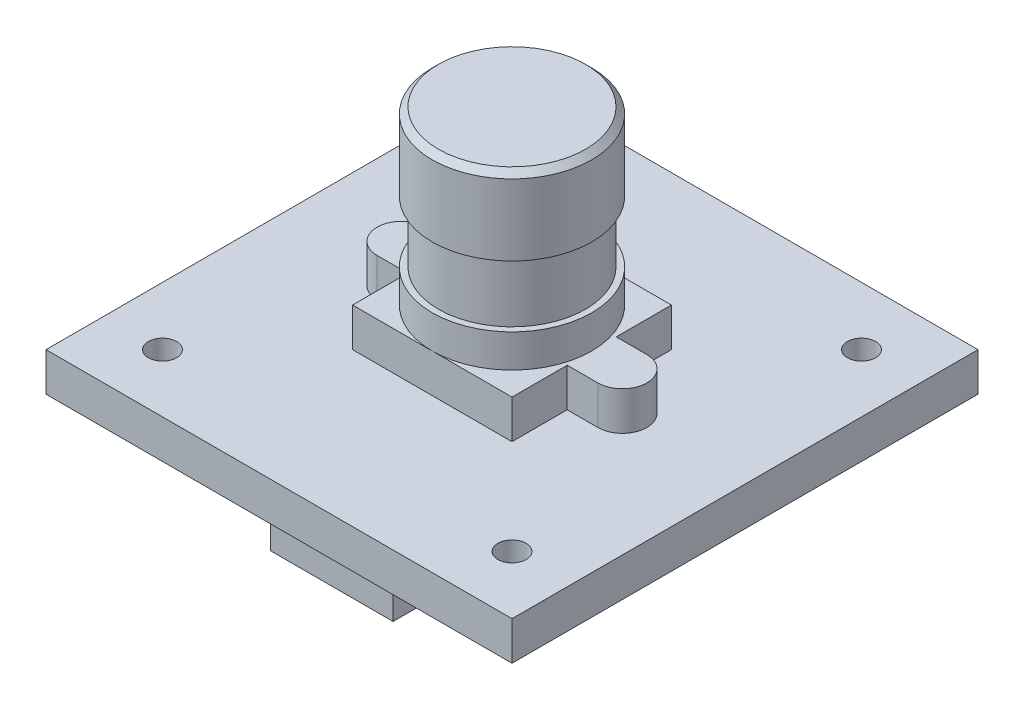
ISO-10303-21;
HEADER;
FILE_DESCRIPTION(('STEP AP214'),'2;1');
FILE_NAME('part.step','',(''),(''),'','','');
FILE_SCHEMA(('AUTOMOTIVE_DESIGN { 1 0 10303 214 1 1 1 1 }'));
ENDSEC;
DATA;
#1=APPLICATION_CONTEXT('core data for automotive mechanical design processes');
#2=APPLICATION_PROTOCOL_DEFINITION('international standard','automotive_design',2000,#1);
#3=PRODUCT_CONTEXT('',#1,'mechanical');
#4=PRODUCT('Part','Part','',(#3));
#5=PRODUCT_RELATED_PRODUCT_CATEGORY('part','',(#4));
#6=PRODUCT_DEFINITION_FORMATION('','',#4);
#7=PRODUCT_DEFINITION_CONTEXT('part definition',#1,'design');
#8=PRODUCT_DEFINITION('design','',#6,#7);
#9=PRODUCT_DEFINITION_SHAPE('','',#8);
#10=(LENGTH_UNIT() NAMED_UNIT(*) SI_UNIT(.MILLI.,.METRE.));
#11=(NAMED_UNIT(*) PLANE_ANGLE_UNIT() SI_UNIT($,.RADIAN.));
#12=(NAMED_UNIT(*) SI_UNIT($,.STERADIAN.) SOLID_ANGLE_UNIT());
#13=UNCERTAINTY_MEASURE_WITH_UNIT(LENGTH_MEASURE(1.E-05),#10,'distance_accuracy_value','');
#14=(GEOMETRIC_REPRESENTATION_CONTEXT(3) GLOBAL_UNCERTAINTY_ASSIGNED_CONTEXT((#13)) GLOBAL_UNIT_ASSIGNED_CONTEXT((#10,
#11,#12)) REPRESENTATION_CONTEXT('',''));
#15=CARTESIAN_POINT('',(0.,0.,0.));
#16=DIRECTION('',(0.,0.,1.));
#17=DIRECTION('',(1.,0.,0.));
#18=AXIS2_PLACEMENT_3D('',#15,#16,#17);
#19=CARTESIAN_POINT('',(0.,20.3,0.));
#20=DIRECTION('',(0.,-1.,0.));
#21=DIRECTION('',(0.,0.,-1.));
#22=AXIS2_PLACEMENT_3D('',#19,#20,#21);
#23=CYLINDRICAL_SURFACE('',#22,6.5);
#24=CARTESIAN_POINT('',(0.,6.3,0.));
#25=DIRECTION('',(0.,1.,0.));
#26=DIRECTION('',(0.,0.,1.));
#27=AXIS2_PLACEMENT_3D('',#24,#25,#26);
#28=CIRCLE('',#27,6.5);
#29=CARTESIAN_POINT('',(0.,6.3,6.5));
#30=VERTEX_POINT('',#29);
#31=CARTESIAN_POINT('',(0.,6.3,-6.5));
#32=VERTEX_POINT('',#31);
#33=EDGE_CURVE('E228',#30,#32,#28,.T.);
#34=ORIENTED_EDGE('',*,*,#33,.T.);
#35=EDGE_CURVE('E60',#32,#30,#28,.T.);
#36=ORIENTED_EDGE('',*,*,#35,.T.);
#37=EDGE_LOOP('',(#34,#36));
#38=FACE_BOUND('',#37,.T.);
#39=CARTESIAN_POINT('',(0.,9.,0.));
#40=DIRECTION('',(0.,1.,0.));
#41=DIRECTION('',(0.,0.,1.));
#42=AXIS2_PLACEMENT_3D('',#39,#40,#41);
#43=CIRCLE('',#42,6.5);
#44=CARTESIAN_POINT('',(0.,9.,6.5));
#45=VERTEX_POINT('',#44);
#46=EDGE_CURVE('E225',#45,#45,#43,.T.);
#47=ORIENTED_EDGE('',*,*,#46,.F.);
#48=EDGE_LOOP('',(#47));
#49=FACE_BOUND('',#48,.T.);
#50=ADVANCED_FACE('F37',(#38,#49),#23,.T.);
#51=CARTESIAN_POINT('',(-9.,6.3,0.));
#52=DIRECTION('',(0.,1.,0.));
#53=DIRECTION('',(0.,0.,1.));
#54=AXIS2_PLACEMENT_3D('',#51,#52,#53);
#55=PLANE('',#54);
#56=ORIENTED_EDGE('',*,*,#33,.F.);
#57=DIRECTION('',(-1.,0.,0.));
#58=VECTOR('',#57,1.);
#59=CARTESIAN_POINT('',(0.,6.3,6.5));
#60=LINE('',#59,#58);
#61=CARTESIAN_POINT('',(6.5,6.3,6.5));
#62=VERTEX_POINT('',#61);
#63=EDGE_CURVE('E246',#62,#30,#60,.T.);
#64=ORIENTED_EDGE('',*,*,#63,.F.);
#65=DIRECTION('',(0.,0.,-1.));
#66=VECTOR('',#65,1.);
#67=CARTESIAN_POINT('',(6.5,6.3,0.));
#68=LINE('',#67,#66);
#69=CARTESIAN_POINT('',(6.5,6.3,2.));
#70=VERTEX_POINT('',#69);
#71=EDGE_CURVE('E248',#62,#70,#68,.T.);
#72=ORIENTED_EDGE('',*,*,#71,.T.);
#73=DIRECTION('',(1.,0.,0.));
#74=VECTOR('',#73,1.);
#75=CARTESIAN_POINT('',(0.,6.3,1.99999999999999));
#76=LINE('',#75,#74);
#77=CARTESIAN_POINT('',(9.,6.3,2.));
#78=VERTEX_POINT('',#77);
#79=EDGE_CURVE('E250',#70,#78,#76,.T.);
#80=ORIENTED_EDGE('',*,*,#79,.T.);
#81=CARTESIAN_POINT('',(9.,6.3,0.));
#82=DIRECTION('',(0.,1.,0.));
#83=DIRECTION('',(0.,0.,1.));
#84=AXIS2_PLACEMENT_3D('',#81,#82,#83);
#85=CIRCLE('',#84,2.);
#86=CARTESIAN_POINT('',(9.,6.3,-2.));
#87=VERTEX_POINT('',#86);
#88=EDGE_CURVE('E252',#78,#87,#85,.T.);
#89=ORIENTED_EDGE('',*,*,#88,.T.);
#90=DIRECTION('',(1.,0.,0.));
#91=VECTOR('',#90,1.);
#92=CARTESIAN_POINT('',(0.,6.3,-2.));
#93=LINE('',#92,#91);
#94=CARTESIAN_POINT('',(6.5,6.3,-2.));
#95=VERTEX_POINT('',#94);
#96=EDGE_CURVE('E254',#95,#87,#93,.T.);
#97=ORIENTED_EDGE('',*,*,#96,.F.);
#98=DIRECTION('',(0.,0.,-1.));
#99=VECTOR('',#98,1.);
#100=CARTESIAN_POINT('',(6.5,6.3,0.));
#101=LINE('',#100,#99);
#102=CARTESIAN_POINT('',(6.5,6.3,-6.5));
#103=VERTEX_POINT('',#102);
#104=EDGE_CURVE('E257',#95,#103,#101,.T.);
#105=ORIENTED_EDGE('',*,*,#104,.T.);
#106=DIRECTION('',(-1.,0.,0.));
#107=VECTOR('',#106,1.);
#108=CARTESIAN_POINT('',(0.,6.3,-6.5));
#109=LINE('',#108,#107);
#110=EDGE_CURVE('E260',#103,#32,#109,.T.);
#111=ORIENTED_EDGE('',*,*,#110,.T.);
#112=EDGE_LOOP('',(#56,#64,#72,#80,#89,#97,#105,#111));
#113=FACE_BOUND('',#112,.T.);
#114=ADVANCED_FACE('F396',(#113),#55,.T.);
#115=CARTESIAN_POINT('',(0.,3.15,0.));
#116=DIRECTION('',(0.,1.,0.));
#117=DIRECTION('',(0.,0.,1.));
#118=AXIS2_PLACEMENT_3D('',#115,#116,#117);
#119=PLANE('',#118);
#120=CARTESIAN_POINT('',(14.25,3.15,14.25));
#121=DIRECTION('',(0.,1.,0.));
#122=DIRECTION('',(0.,0.,-1.));
#123=AXIS2_PLACEMENT_3D('',#120,#121,#122);
#124=CIRCLE('',#123,1.15);
#125=CARTESIAN_POINT('',(14.25,3.15,13.1));
#126=VERTEX_POINT('',#125);
#127=EDGE_CURVE('E338',#126,#126,#124,.T.);
#128=ORIENTED_EDGE('',*,*,#127,.F.);
#129=EDGE_LOOP('',(#128));
#130=FACE_BOUND('',#129,.T.);
#131=CARTESIAN_POINT('',(14.25,3.15,-14.25));
#132=DIRECTION('',(0.,1.,0.));
#133=DIRECTION('',(0.,0.,1.));
#134=AXIS2_PLACEMENT_3D('',#131,#132,#133);
#135=CIRCLE('',#134,1.15);
#136=CARTESIAN_POINT('',(14.25,3.15,-13.1));
#137=VERTEX_POINT('',#136);
#138=EDGE_CURVE('E350',#137,#137,#135,.T.);
#139=ORIENTED_EDGE('',*,*,#138,.F.);
#140=EDGE_LOOP('',(#139));
#141=FACE_BOUND('',#140,.T.);
#142=DIRECTION('',(0.,0.,1.));
#143=VECTOR('',#142,1.);
#144=CARTESIAN_POINT('',(-19.,3.15,-19.));
#145=LINE('',#144,#143);
#146=CARTESIAN_POINT('',(-19.,3.15,-19.));
#147=VERTEX_POINT('',#146);
#148=CARTESIAN_POINT('',(-19.,3.15,19.));
#149=VERTEX_POINT('',#148);
#150=EDGE_CURVE('E356',#147,#149,#145,.T.);
#151=ORIENTED_EDGE('',*,*,#150,.T.);
#152=DIRECTION('',(1.,0.,0.));
#153=VECTOR('',#152,1.);
#154=CARTESIAN_POINT('',(-19.,3.15,19.));
#155=LINE('',#154,#153);
#156=CARTESIAN_POINT('',(19.,3.15,19.));
#157=VERTEX_POINT('',#156);
#158=EDGE_CURVE('E359',#149,#157,#155,.T.);
#159=ORIENTED_EDGE('',*,*,#158,.T.);
#160=DIRECTION('',(0.,0.,-1.));
#161=VECTOR('',#160,1.);
#162=CARTESIAN_POINT('',(19.,3.15,-19.));
#163=LINE('',#162,#161);
#164=CARTESIAN_POINT('',(19.,3.15,-19.));
#165=VERTEX_POINT('',#164);
#166=EDGE_CURVE('E362',#157,#165,#163,.T.);
#167=ORIENTED_EDGE('',*,*,#166,.T.);
#168=DIRECTION('',(-1.,0.,0.));
#169=VECTOR('',#168,1.);
#170=CARTESIAN_POINT('',(-19.,3.15,-19.));
#171=LINE('',#170,#169);
#172=EDGE_CURVE('E364',#165,#147,#171,.T.);
#173=ORIENTED_EDGE('',*,*,#172,.T.);
#174=EDGE_LOOP('',(#151,#159,#167,#173));
#175=FACE_BOUND('',#174,.T.);
#176=CARTESIAN_POINT('',(-14.25,3.15,-14.25));
#177=DIRECTION('',(0.,1.,0.));
#178=DIRECTION('',(0.,0.,-1.));
#179=AXIS2_PLACEMENT_3D('',#176,#177,#178);
#180=CIRCLE('',#179,1.15);
#181=CARTESIAN_POINT('',(-14.25,3.15,-15.4));
#182=VERTEX_POINT('',#181);
#183=EDGE_CURVE('E344',#182,#182,#180,.T.);
#184=ORIENTED_EDGE('',*,*,#183,.F.);
#185=EDGE_LOOP('',(#184));
#186=FACE_BOUND('',#185,.T.);
#187=CARTESIAN_POINT('',(-14.25,3.15,14.25));
#188=DIRECTION('',(0.,1.,0.));
#189=DIRECTION('',(0.,0.,1.));
#190=AXIS2_PLACEMENT_3D('',#187,#188,#189);
#191=CIRCLE('',#190,1.15);
#192=CARTESIAN_POINT('',(-14.25,3.15,15.4));
#193=VERTEX_POINT('',#192);
#194=EDGE_CURVE('E332',#193,#193,#191,.T.);
#195=ORIENTED_EDGE('',*,*,#194,.F.);
#196=EDGE_LOOP('',(#195));
#197=FACE_BOUND('',#196,.T.);
#198=CARTESIAN_POINT('',(-9.,3.15,0.));
#199=DIRECTION('',(0.,1.,0.));
#200=DIRECTION('',(0.,0.,1.));
#201=AXIS2_PLACEMENT_3D('',#198,#199,#200);
#202=CIRCLE('',#201,2.);
#203=CARTESIAN_POINT('',(-9.,3.15,-2.));
#204=VERTEX_POINT('',#203);
#205=CARTESIAN_POINT('',(-9.,3.15,2.));
#206=VERTEX_POINT('',#205);
#207=EDGE_CURVE('E269',#204,#206,#202,.T.);
#208=ORIENTED_EDGE('',*,*,#207,.F.);
#209=DIRECTION('',(-1.,0.,0.));
#210=VECTOR('',#209,1.);
#211=CARTESIAN_POINT('',(0.,3.15,-2.));
#212=LINE('',#211,#210);
#213=CARTESIAN_POINT('',(-6.5,3.15,-2.));
#214=VERTEX_POINT('',#213);
#215=EDGE_CURVE('E231',#214,#204,#212,.T.);
#216=ORIENTED_EDGE('',*,*,#215,.F.);
#217=DIRECTION('',(0.,0.,-1.));
#218=VECTOR('',#217,1.);
#219=CARTESIAN_POINT('',(-6.5,3.15,0.));
#220=LINE('',#219,#218);
#221=CARTESIAN_POINT('',(-6.5,3.15,-6.5));
#222=VERTEX_POINT('',#221);
#223=EDGE_CURVE('E237',#214,#222,#220,.T.);
#224=ORIENTED_EDGE('',*,*,#223,.T.);
#225=DIRECTION('',(-1.,0.,0.));
#226=VECTOR('',#225,1.);
#227=CARTESIAN_POINT('',(0.,3.15,-6.5));
#228=LINE('',#227,#226);
#229=CARTESIAN_POINT('',(6.5,3.15,-6.5));
#230=VERTEX_POINT('',#229);
#231=EDGE_CURVE('E292',#230,#222,#228,.T.);
#232=ORIENTED_EDGE('',*,*,#231,.F.);
#233=DIRECTION('',(0.,0.,-1.));
#234=VECTOR('',#233,1.);
#235=CARTESIAN_POINT('',(6.5,3.15,0.));
#236=LINE('',#235,#234);
#237=CARTESIAN_POINT('',(6.5,3.15,-2.));
#238=VERTEX_POINT('',#237);
#239=EDGE_CURVE('E289',#238,#230,#236,.T.);
#240=ORIENTED_EDGE('',*,*,#239,.F.);
#241=DIRECTION('',(1.,0.,0.));
#242=VECTOR('',#241,1.);
#243=CARTESIAN_POINT('',(0.,3.15,-2.));
#244=LINE('',#243,#242);
#245=CARTESIAN_POINT('',(9.,3.15,-2.));
#246=VERTEX_POINT('',#245);
#247=EDGE_CURVE('E287',#238,#246,#244,.T.);
#248=ORIENTED_EDGE('',*,*,#247,.T.);
#249=CARTESIAN_POINT('',(9.,3.15,0.));
#250=DIRECTION('',(0.,1.,0.));
#251=DIRECTION('',(0.,0.,1.));
#252=AXIS2_PLACEMENT_3D('',#249,#250,#251);
#253=CIRCLE('',#252,2.);
#254=CARTESIAN_POINT('',(9.,3.15,2.));
#255=VERTEX_POINT('',#254);
#256=EDGE_CURVE('E284',#255,#246,#253,.T.);
#257=ORIENTED_EDGE('',*,*,#256,.F.);
#258=DIRECTION('',(1.,0.,0.));
#259=VECTOR('',#258,1.);
#260=CARTESIAN_POINT('',(0.,3.15,1.99999999999999));
#261=LINE('',#260,#259);
#262=CARTESIAN_POINT('',(6.5,3.15,2.));
#263=VERTEX_POINT('',#262);
#264=EDGE_CURVE('E281',#263,#255,#261,.T.);
#265=ORIENTED_EDGE('',*,*,#264,.F.);
#266=DIRECTION('',(0.,0.,-1.));
#267=VECTOR('',#266,1.);
#268=CARTESIAN_POINT('',(6.5,3.15,0.));
#269=LINE('',#268,#267);
#270=CARTESIAN_POINT('',(6.5,3.15,6.5));
#271=VERTEX_POINT('',#270);
#272=EDGE_CURVE('E278',#271,#263,#269,.T.);
#273=ORIENTED_EDGE('',*,*,#272,.F.);
#274=DIRECTION('',(-1.,0.,0.));
#275=VECTOR('',#274,1.);
#276=CARTESIAN_POINT('',(0.,3.15,6.5));
#277=LINE('',#276,#275);
#278=CARTESIAN_POINT('',(-6.5,3.15,6.5));
#279=VERTEX_POINT('',#278);
#280=EDGE_CURVE('E276',#271,#279,#277,.T.);
#281=ORIENTED_EDGE('',*,*,#280,.T.);
#282=DIRECTION('',(0.,0.,-1.));
#283=VECTOR('',#282,1.);
#284=CARTESIAN_POINT('',(-6.5,3.15,0.));
#285=LINE('',#284,#283);
#286=CARTESIAN_POINT('',(-6.5,3.15,2.));
#287=VERTEX_POINT('',#286);
#288=EDGE_CURVE('E274',#279,#287,#285,.T.);
#289=ORIENTED_EDGE('',*,*,#288,.T.);
#290=DIRECTION('',(-1.,0.,0.));
#291=VECTOR('',#290,1.);
#292=CARTESIAN_POINT('',(0.,3.15,1.99999999999999));
#293=LINE('',#292,#291);
#294=EDGE_CURVE('E272',#287,#206,#293,.T.);
#295=ORIENTED_EDGE('',*,*,#294,.T.);
#296=EDGE_LOOP('',(#208,#216,#224,#232,#240,#248,#257,#265,#273,#281,#289,#295));
#297=FACE_BOUND('',#296,.T.);
#298=ADVANCED_FACE('F445',(#130,#141,#175,#186,#197,#297),#119,.T.);
#299=CARTESIAN_POINT('',(0.,0.,0.));
#300=DIRECTION('',(0.,1.,0.));
#301=DIRECTION('',(0.,0.,1.));
#302=AXIS2_PLACEMENT_3D('',#299,#300,#301);
#303=PLANE('',#302);
#304=DIRECTION('',(-1.,0.,0.));
#305=VECTOR('',#304,1.);
#306=CARTESIAN_POINT('',(-5.,0.,10.));
#307=LINE('',#306,#305);
#308=CARTESIAN_POINT('',(5.,0.,9.99999999999999));
#309=VERTEX_POINT('',#308);
#310=CARTESIAN_POINT('',(-5.,0.,10.));
#311=VERTEX_POINT('',#310);
#312=EDGE_CURVE('E206',#309,#311,#307,.T.);
#313=ORIENTED_EDGE('',*,*,#312,.T.);
#314=DIRECTION('',(0.,0.,1.));
#315=VECTOR('',#314,1.);
#316=CARTESIAN_POINT('',(-5.,0.,10.));
#317=LINE('',#316,#315);
#318=CARTESIAN_POINT('',(-5.,0.,14.7));
#319=VERTEX_POINT('',#318);
#320=EDGE_CURVE('E213',#311,#319,#317,.T.);
#321=ORIENTED_EDGE('',*,*,#320,.T.);
#322=DIRECTION('',(1.,0.,0.));
#323=VECTOR('',#322,1.);
#324=CARTESIAN_POINT('',(-5.,0.,14.7));
#325=LINE('',#324,#323);
#326=CARTESIAN_POINT('',(5.,0.,14.7));
#327=VERTEX_POINT('',#326);
#328=EDGE_CURVE('E186',#319,#327,#325,.T.);
#329=ORIENTED_EDGE('',*,*,#328,.T.);
#330=DIRECTION('',(0.,0.,-1.));
#331=VECTOR('',#330,1.);
#332=CARTESIAN_POINT('',(5.,0.,9.99999999999999));
#333=LINE('',#332,#331);
#334=EDGE_CURVE('E52',#327,#309,#333,.T.);
#335=ORIENTED_EDGE('',*,*,#334,.T.);
#336=EDGE_LOOP('',(#313,#321,#329,#335));
#337=FACE_BOUND('',#336,.T.);
#338=DIRECTION('',(0.,0.,1.));
#339=VECTOR('',#338,1.);
#340=CARTESIAN_POINT('',(-19.,0.,-19.));
#341=LINE('',#340,#339);
#342=CARTESIAN_POINT('',(-19.,0.,-19.));
#343=VERTEX_POINT('',#342);
#344=CARTESIAN_POINT('',(-19.,0.,19.));
#345=VERTEX_POINT('',#344);
#346=EDGE_CURVE('E353',#343,#345,#341,.T.);
#347=ORIENTED_EDGE('',*,*,#346,.F.);
#348=DIRECTION('',(-1.,0.,0.));
#349=VECTOR('',#348,1.);
#350=CARTESIAN_POINT('',(-19.,0.,-19.));
#351=LINE('',#350,#349);
#352=CARTESIAN_POINT('',(19.,0.,-19.));
#353=VERTEX_POINT('',#352);
#354=EDGE_CURVE('E360',#353,#343,#351,.T.);
#355=ORIENTED_EDGE('',*,*,#354,.F.);
#356=DIRECTION('',(0.,0.,-1.));
#357=VECTOR('',#356,1.);
#358=CARTESIAN_POINT('',(19.,0.,-19.));
#359=LINE('',#358,#357);
#360=CARTESIAN_POINT('',(19.,0.,19.));
#361=VERTEX_POINT('',#360);
#362=EDGE_CURVE('E371',#361,#353,#359,.T.);
#363=ORIENTED_EDGE('',*,*,#362,.F.);
#364=DIRECTION('',(1.,0.,0.));
#365=VECTOR('',#364,1.);
#366=CARTESIAN_POINT('',(-19.,0.,19.));
#367=LINE('',#366,#365);
#368=EDGE_CURVE('E369',#345,#361,#367,.T.);
#369=ORIENTED_EDGE('',*,*,#368,.F.);
#370=EDGE_LOOP('',(#347,#355,#363,#369));
#371=FACE_BOUND('',#370,.T.);
#372=CARTESIAN_POINT('',(14.25,0.,-14.25));
#373=DIRECTION('',(0.,1.,0.));
#374=DIRECTION('',(0.,0.,1.));
#375=AXIS2_PLACEMENT_3D('',#372,#373,#374);
#376=CIRCLE('',#375,1.15);
#377=CARTESIAN_POINT('',(14.25,0.,-13.1));
#378=VERTEX_POINT('',#377);
#379=EDGE_CURVE('E347',#378,#378,#376,.T.);
#380=ORIENTED_EDGE('',*,*,#379,.T.);
#381=EDGE_LOOP('',(#380));
#382=FACE_BOUND('',#381,.T.);
#383=CARTESIAN_POINT('',(-14.25,0.,-14.25));
#384=DIRECTION('',(0.,1.,0.));
#385=DIRECTION('',(0.,0.,-1.));
#386=AXIS2_PLACEMENT_3D('',#383,#384,#385);
#387=CIRCLE('',#386,1.15);
#388=CARTESIAN_POINT('',(-14.25,0.,-15.4));
#389=VERTEX_POINT('',#388);
#390=EDGE_CURVE('E341',#389,#389,#387,.T.);
#391=ORIENTED_EDGE('',*,*,#390,.T.);
#392=EDGE_LOOP('',(#391));
#393=FACE_BOUND('',#392,.T.);
#394=CARTESIAN_POINT('',(14.25,0.,14.25));
#395=DIRECTION('',(0.,1.,0.));
#396=DIRECTION('',(0.,0.,-1.));
#397=AXIS2_PLACEMENT_3D('',#394,#395,#396);
#398=CIRCLE('',#397,1.15);
#399=CARTESIAN_POINT('',(14.25,0.,13.1));
#400=VERTEX_POINT('',#399);
#401=EDGE_CURVE('E335',#400,#400,#398,.T.);
#402=ORIENTED_EDGE('',*,*,#401,.T.);
#403=EDGE_LOOP('',(#402));
#404=FACE_BOUND('',#403,.T.);
#405=CARTESIAN_POINT('',(-14.25,0.,14.25));
#406=DIRECTION('',(0.,1.,0.));
#407=DIRECTION('',(0.,0.,1.));
#408=AXIS2_PLACEMENT_3D('',#405,#406,#407);
#409=CIRCLE('',#408,1.15);
#410=CARTESIAN_POINT('',(-14.25,0.,15.4));
#411=VERTEX_POINT('',#410);
#412=EDGE_CURVE('E331',#411,#411,#409,.T.);
#413=ORIENTED_EDGE('',*,*,#412,.T.);
#414=EDGE_LOOP('',(#413));
#415=FACE_BOUND('',#414,.T.);
#416=ADVANCED_FACE('F674',(#337,#371,#382,#393,#404,#415),#303,.F.);
#417=CARTESIAN_POINT('',(-19.,3.15,-19.));
#418=DIRECTION('',(1.,0.,0.));
#419=DIRECTION('',(0.,0.,-1.));
#420=AXIS2_PLACEMENT_3D('',#417,#418,#419);
#421=PLANE('',#420);
#422=ORIENTED_EDGE('',*,*,#346,.T.);
#423=DIRECTION('',(0.,-1.,0.));
#424=VECTOR('',#423,1.);
#425=CARTESIAN_POINT('',(-19.,3.15,19.));
#426=LINE('',#425,#424);
#427=EDGE_CURVE('E382',#149,#345,#426,.T.);
#428=ORIENTED_EDGE('',*,*,#427,.F.);
#429=ORIENTED_EDGE('',*,*,#150,.F.);
#430=DIRECTION('',(0.,-1.,0.));
#431=VECTOR('',#430,1.);
#432=CARTESIAN_POINT('',(-19.,3.15,-19.));
#433=LINE('',#432,#431);
#434=EDGE_CURVE('E366',#147,#343,#433,.T.);
#435=ORIENTED_EDGE('',*,*,#434,.T.);
#436=EDGE_LOOP('',(#422,#428,#429,#435));
#437=FACE_BOUND('',#436,.T.);
#438=ADVANCED_FACE('F744',(#437),#421,.F.);
#439=CARTESIAN_POINT('',(-19.,3.15,19.));
#440=DIRECTION('',(0.,0.,-1.));
#441=DIRECTION('',(-1.,0.,0.));
#442=AXIS2_PLACEMENT_3D('',#439,#440,#441);
#443=PLANE('',#442);
#444=ORIENTED_EDGE('',*,*,#368,.T.);
#445=DIRECTION('',(0.,-1.,0.));
#446=VECTOR('',#445,1.);
#447=CARTESIAN_POINT('',(19.,3.15,19.));
#448=LINE('',#447,#446);
#449=EDGE_CURVE('E379',#157,#361,#448,.T.);
#450=ORIENTED_EDGE('',*,*,#449,.F.);
#451=ORIENTED_EDGE('',*,*,#158,.F.);
#452=ORIENTED_EDGE('',*,*,#427,.T.);
#453=EDGE_LOOP('',(#444,#450,#451,#452));
#454=FACE_BOUND('',#453,.T.);
#455=ADVANCED_FACE('F734',(#454),#443,.F.);
#456=CARTESIAN_POINT('',(19.,3.15,-19.));
#457=DIRECTION('',(-1.,0.,0.));
#458=DIRECTION('',(0.,0.,1.));
#459=AXIS2_PLACEMENT_3D('',#456,#457,#458);
#460=PLANE('',#459);
#461=ORIENTED_EDGE('',*,*,#362,.T.);
#462=DIRECTION('',(0.,-1.,0.));
#463=VECTOR('',#462,1.);
#464=CARTESIAN_POINT('',(19.,3.15,-19.));
#465=LINE('',#464,#463);
#466=EDGE_CURVE('E376',#165,#353,#465,.T.);
#467=ORIENTED_EDGE('',*,*,#466,.F.);
#468=ORIENTED_EDGE('',*,*,#166,.F.);
#469=ORIENTED_EDGE('',*,*,#449,.T.);
#470=EDGE_LOOP('',(#461,#467,#468,#469));
#471=FACE_BOUND('',#470,.T.);
#472=ADVANCED_FACE('F724',(#471),#460,.F.);
#473=CARTESIAN_POINT('',(-19.,3.15,-19.));
#474=DIRECTION('',(0.,0.,1.));
#475=DIRECTION('',(1.,0.,0.));
#476=AXIS2_PLACEMENT_3D('',#473,#474,#475);
#477=PLANE('',#476);
#478=ORIENTED_EDGE('',*,*,#354,.T.);
#479=ORIENTED_EDGE('',*,*,#434,.F.);
#480=ORIENTED_EDGE('',*,*,#172,.F.);
#481=ORIENTED_EDGE('',*,*,#466,.T.);
#482=EDGE_LOOP('',(#478,#479,#480,#481));
#483=FACE_BOUND('',#482,.T.);
#484=ADVANCED_FACE('F714',(#483),#477,.F.);
#485=CARTESIAN_POINT('',(14.25,3.15,-14.25));
#486=DIRECTION('',(0.,-1.,0.));
#487=DIRECTION('',(0.,0.,-1.));
#488=AXIS2_PLACEMENT_3D('',#485,#486,#487);
#489=CYLINDRICAL_SURFACE('',#488,1.15);
#490=ORIENTED_EDGE('',*,*,#138,.T.);
#491=EDGE_LOOP('',(#490));
#492=FACE_BOUND('',#491,.T.);
#493=ORIENTED_EDGE('',*,*,#379,.F.);
#494=EDGE_LOOP('',(#493));
#495=FACE_BOUND('',#494,.T.);
#496=ADVANCED_FACE('F704',(#492,#495),#489,.F.);
#497=CARTESIAN_POINT('',(-14.25,3.15,-14.25));
#498=DIRECTION('',(0.,-1.,0.));
#499=DIRECTION('',(0.,0.,-1.));
#500=AXIS2_PLACEMENT_3D('',#497,#498,#499);
#501=CYLINDRICAL_SURFACE('',#500,1.15);
#502=ORIENTED_EDGE('',*,*,#183,.T.);
#503=EDGE_LOOP('',(#502));
#504=FACE_BOUND('',#503,.T.);
#505=ORIENTED_EDGE('',*,*,#390,.F.);
#506=EDGE_LOOP('',(#505));
#507=FACE_BOUND('',#506,.T.);
#508=ADVANCED_FACE('F694',(#504,#507),#501,.F.);
#509=CARTESIAN_POINT('',(14.25,3.15,14.25));
#510=DIRECTION('',(0.,-1.,0.));
#511=DIRECTION('',(0.,0.,-1.));
#512=AXIS2_PLACEMENT_3D('',#509,#510,#511);
#513=CYLINDRICAL_SURFACE('',#512,1.15);
#514=ORIENTED_EDGE('',*,*,#127,.T.);
#515=EDGE_LOOP('',(#514));
#516=FACE_BOUND('',#515,.T.);
#517=ORIENTED_EDGE('',*,*,#401,.F.);
#518=EDGE_LOOP('',(#517));
#519=FACE_BOUND('',#518,.T.);
#520=ADVANCED_FACE('F684',(#516,#519),#513,.F.);
#521=CARTESIAN_POINT('',(-14.25,3.15,14.25));
#522=DIRECTION('',(0.,-1.,0.));
#523=DIRECTION('',(0.,0.,-1.));
#524=AXIS2_PLACEMENT_3D('',#521,#522,#523);
#525=CYLINDRICAL_SURFACE('',#524,1.15);
#526=ORIENTED_EDGE('',*,*,#194,.T.);
#527=EDGE_LOOP('',(#526));
#528=FACE_BOUND('',#527,.T.);
#529=ORIENTED_EDGE('',*,*,#412,.F.);
#530=EDGE_LOOP('',(#529));
#531=FACE_BOUND('',#530,.T.);
#532=ADVANCED_FACE('F665',(#528,#531),#525,.F.);
#533=CARTESIAN_POINT('',(0.,6.3,-2.));
#534=DIRECTION('',(0.,0.,1.));
#535=DIRECTION('',(1.,0.,0.));
#536=AXIS2_PLACEMENT_3D('',#533,#534,#535);
#537=PLANE('',#536);
#538=ORIENTED_EDGE('',*,*,#215,.T.);
#539=DIRECTION('',(0.,-1.,0.));
#540=VECTOR('',#539,1.);
#541=CARTESIAN_POINT('',(-9.,6.3,-2.));
#542=LINE('',#541,#540);
#543=CARTESIAN_POINT('',(-9.,6.3,-2.));
#544=VERTEX_POINT('',#543);
#545=EDGE_CURVE('E328',#544,#204,#542,.T.);
#546=ORIENTED_EDGE('',*,*,#545,.F.);
#547=DIRECTION('',(-1.,0.,0.));
#548=VECTOR('',#547,1.);
#549=CARTESIAN_POINT('',(0.,6.3,-2.));
#550=LINE('',#549,#548);
#551=CARTESIAN_POINT('',(-6.5,6.3,-2.));
#552=VERTEX_POINT('',#551);
#553=EDGE_CURVE('E233',#552,#544,#550,.T.);
#554=ORIENTED_EDGE('',*,*,#553,.F.);
#555=DIRECTION('',(0.,-1.,0.));
#556=VECTOR('',#555,1.);
#557=CARTESIAN_POINT('',(-6.5,6.3,-2.));
#558=LINE('',#557,#556);
#559=EDGE_CURVE('E266',#552,#214,#558,.T.);
#560=ORIENTED_EDGE('',*,*,#559,.T.);
#561=EDGE_LOOP('',(#538,#546,#554,#560));
#562=FACE_BOUND('',#561,.T.);
#563=ADVANCED_FACE('F412',(#562),#537,.F.);
#564=CARTESIAN_POINT('',(-9.,6.3,0.));
#565=DIRECTION('',(0.,-1.,0.));
#566=DIRECTION('',(0.,0.,-1.));
#567=AXIS2_PLACEMENT_3D('',#564,#565,#566);
#568=CYLINDRICAL_SURFACE('',#567,2.);
#569=ORIENTED_EDGE('',*,*,#207,.T.);
#570=DIRECTION('',(0.,-1.,0.));
#571=VECTOR('',#570,1.);
#572=CARTESIAN_POINT('',(-9.,6.3,2.));
#573=LINE('',#572,#571);
#574=CARTESIAN_POINT('',(-9.,6.3,2.));
#575=VERTEX_POINT('',#574);
#576=EDGE_CURVE('E325',#575,#206,#573,.T.);
#577=ORIENTED_EDGE('',*,*,#576,.F.);
#578=CARTESIAN_POINT('',(-9.,6.3,0.));
#579=DIRECTION('',(0.,1.,0.));
#580=DIRECTION('',(0.,0.,1.));
#581=AXIS2_PLACEMENT_3D('',#578,#579,#580);
#582=CIRCLE('',#581,2.);
#583=EDGE_CURVE('E236',#544,#575,#582,.T.);
#584=ORIENTED_EDGE('',*,*,#583,.F.);
#585=ORIENTED_EDGE('',*,*,#545,.T.);
#586=EDGE_LOOP('',(#569,#577,#584,#585));
#587=FACE_BOUND('',#586,.T.);
#588=ADVANCED_FACE('F414',(#587),#568,.T.);
#589=CARTESIAN_POINT('',(0.,6.3,1.99999999999999));
#590=DIRECTION('',(0.,0.,1.));
#591=DIRECTION('',(1.,0.,0.));
#592=AXIS2_PLACEMENT_3D('',#589,#590,#591);
#593=PLANE('',#592);
#594=ORIENTED_EDGE('',*,*,#294,.F.);
#595=DIRECTION('',(0.,-1.,0.));
#596=VECTOR('',#595,1.);
#597=CARTESIAN_POINT('',(-6.5,6.3,2.));
#598=LINE('',#597,#596);
#599=CARTESIAN_POINT('',(-6.5,6.3,2.));
#600=VERTEX_POINT('',#599);
#601=EDGE_CURVE('E322',#600,#287,#598,.T.);
#602=ORIENTED_EDGE('',*,*,#601,.F.);
#603=DIRECTION('',(-1.,0.,0.));
#604=VECTOR('',#603,1.);
#605=CARTESIAN_POINT('',(0.,6.3,1.99999999999999));
#606=LINE('',#605,#604);
#607=EDGE_CURVE('E239',#600,#575,#606,.T.);
#608=ORIENTED_EDGE('',*,*,#607,.T.);
#609=ORIENTED_EDGE('',*,*,#576,.T.);
#610=EDGE_LOOP('',(#594,#602,#608,#609));
#611=FACE_BOUND('',#610,.T.);
#612=ADVANCED_FACE('F446',(#611),#593,.T.);
#613=CARTESIAN_POINT('',(-6.5,6.3,0.));
#614=DIRECTION('',(-1.,0.,0.));
#615=DIRECTION('',(0.,0.,1.));
#616=AXIS2_PLACEMENT_3D('',#613,#614,#615);
#617=PLANE('',#616);
#618=ORIENTED_EDGE('',*,*,#288,.F.);
#619=DIRECTION('',(0.,-1.,0.));
#620=VECTOR('',#619,1.);
#621=CARTESIAN_POINT('',(-6.5,6.3,6.5));
#622=LINE('',#621,#620);
#623=CARTESIAN_POINT('',(-6.5,6.3,6.5));
#624=VERTEX_POINT('',#623);
#625=EDGE_CURVE('E319',#624,#279,#622,.T.);
#626=ORIENTED_EDGE('',*,*,#625,.F.);
#627=DIRECTION('',(0.,0.,-1.));
#628=VECTOR('',#627,1.);
#629=CARTESIAN_POINT('',(-6.5,6.3,0.));
#630=LINE('',#629,#628);
#631=EDGE_CURVE('E242',#624,#600,#630,.T.);
#632=ORIENTED_EDGE('',*,*,#631,.T.);
#633=ORIENTED_EDGE('',*,*,#601,.T.);
#634=EDGE_LOOP('',(#618,#626,#632,#633));
#635=FACE_BOUND('',#634,.T.);
#636=ADVANCED_FACE('F422',(#635),#617,.T.);
#637=CARTESIAN_POINT('',(0.,6.3,6.5));
#638=DIRECTION('',(0.,0.,1.));
#639=DIRECTION('',(1.,0.,0.));
#640=AXIS2_PLACEMENT_3D('',#637,#638,#639);
#641=PLANE('',#640);
#642=ORIENTED_EDGE('',*,*,#280,.F.);
#643=DIRECTION('',(0.,-1.,0.));
#644=VECTOR('',#643,1.);
#645=CARTESIAN_POINT('',(6.5,6.3,6.5));
#646=LINE('',#645,#644);
#647=EDGE_CURVE('E316',#62,#271,#646,.T.);
#648=ORIENTED_EDGE('',*,*,#647,.F.);
#649=ORIENTED_EDGE('',*,*,#63,.T.);
#650=EDGE_CURVE('E245',#30,#624,#60,.T.);
#651=ORIENTED_EDGE('',*,*,#650,.T.);
#652=ORIENTED_EDGE('',*,*,#625,.T.);
#653=EDGE_LOOP('',(#642,#648,#649,#651,#652));
#654=FACE_BOUND('',#653,.T.);
#655=ADVANCED_FACE('F426',(#654),#641,.T.);
#656=CARTESIAN_POINT('',(6.5,6.3,0.));
#657=DIRECTION('',(-1.,0.,0.));
#658=DIRECTION('',(0.,0.,1.));
#659=AXIS2_PLACEMENT_3D('',#656,#657,#658);
#660=PLANE('',#659);
#661=ORIENTED_EDGE('',*,*,#272,.T.);
#662=DIRECTION('',(0.,-1.,0.));
#663=VECTOR('',#662,1.);
#664=CARTESIAN_POINT('',(6.5,6.3,2.));
#665=LINE('',#664,#663);
#666=EDGE_CURVE('E313',#70,#263,#665,.T.);
#667=ORIENTED_EDGE('',*,*,#666,.F.);
#668=ORIENTED_EDGE('',*,*,#71,.F.);
#669=ORIENTED_EDGE('',*,*,#647,.T.);
#670=EDGE_LOOP('',(#661,#667,#668,#669));
#671=FACE_BOUND('',#670,.T.);
#672=ADVANCED_FACE('F430',(#671),#660,.F.);
#673=CARTESIAN_POINT('',(0.,6.3,1.99999999999999));
#674=DIRECTION('',(0.,0.,-1.));
#675=DIRECTION('',(-1.,0.,0.));
#676=AXIS2_PLACEMENT_3D('',#673,#674,#675);
#677=PLANE('',#676);
#678=ORIENTED_EDGE('',*,*,#264,.T.);
#679=DIRECTION('',(0.,-1.,0.));
#680=VECTOR('',#679,1.);
#681=CARTESIAN_POINT('',(9.,6.3,2.));
#682=LINE('',#681,#680);
#683=EDGE_CURVE('E310',#78,#255,#682,.T.);
#684=ORIENTED_EDGE('',*,*,#683,.F.);
#685=ORIENTED_EDGE('',*,*,#79,.F.);
#686=ORIENTED_EDGE('',*,*,#666,.T.);
#687=EDGE_LOOP('',(#678,#684,#685,#686));
#688=FACE_BOUND('',#687,.T.);
#689=ADVANCED_FACE('F436',(#688),#677,.F.);
#690=CARTESIAN_POINT('',(9.,6.3,0.));
#691=DIRECTION('',(0.,-1.,0.));
#692=DIRECTION('',(0.,0.,-1.));
#693=AXIS2_PLACEMENT_3D('',#690,#691,#692);
#694=CYLINDRICAL_SURFACE('',#693,2.);
#695=ORIENTED_EDGE('',*,*,#256,.T.);
#696=DIRECTION('',(0.,-1.,0.));
#697=VECTOR('',#696,1.);
#698=CARTESIAN_POINT('',(9.,6.3,-2.));
#699=LINE('',#698,#697);
#700=EDGE_CURVE('E307',#87,#246,#699,.T.);
#701=ORIENTED_EDGE('',*,*,#700,.F.);
#702=ORIENTED_EDGE('',*,*,#88,.F.);
#703=ORIENTED_EDGE('',*,*,#683,.T.);
#704=EDGE_LOOP('',(#695,#701,#702,#703));
#705=FACE_BOUND('',#704,.T.);
#706=ADVANCED_FACE('F438',(#705),#694,.T.);
#707=CARTESIAN_POINT('',(0.,6.3,-2.));
#708=DIRECTION('',(0.,0.,-1.));
#709=DIRECTION('',(-1.,0.,0.));
#710=AXIS2_PLACEMENT_3D('',#707,#708,#709);
#711=PLANE('',#710);
#712=ORIENTED_EDGE('',*,*,#247,.F.);
#713=DIRECTION('',(0.,-1.,0.));
#714=VECTOR('',#713,1.);
#715=CARTESIAN_POINT('',(6.5,6.3,-2.));
#716=LINE('',#715,#714);
#717=EDGE_CURVE('E304',#95,#238,#716,.T.);
#718=ORIENTED_EDGE('',*,*,#717,.F.);
#719=ORIENTED_EDGE('',*,*,#96,.T.);
#720=ORIENTED_EDGE('',*,*,#700,.T.);
#721=EDGE_LOOP('',(#712,#718,#719,#720));
#722=FACE_BOUND('',#721,.T.);
#723=ADVANCED_FACE('F441',(#722),#711,.T.);
#724=CARTESIAN_POINT('',(6.5,6.3,0.));
#725=DIRECTION('',(-1.,0.,0.));
#726=DIRECTION('',(0.,0.,1.));
#727=AXIS2_PLACEMENT_3D('',#724,#725,#726);
#728=PLANE('',#727);
#729=ORIENTED_EDGE('',*,*,#239,.T.);
#730=DIRECTION('',(0.,-1.,0.));
#731=VECTOR('',#730,1.);
#732=CARTESIAN_POINT('',(6.5,6.3,-6.5));
#733=LINE('',#732,#731);
#734=EDGE_CURVE('E301',#103,#230,#733,.T.);
#735=ORIENTED_EDGE('',*,*,#734,.F.);
#736=ORIENTED_EDGE('',*,*,#104,.F.);
#737=ORIENTED_EDGE('',*,*,#717,.T.);
#738=EDGE_LOOP('',(#729,#735,#736,#737));
#739=FACE_BOUND('',#738,.T.);
#740=ADVANCED_FACE('F443',(#739),#728,.F.);
#741=CARTESIAN_POINT('',(0.,6.3,-6.5));
#742=DIRECTION('',(0.,0.,1.));
#743=DIRECTION('',(1.,0.,0.));
#744=AXIS2_PLACEMENT_3D('',#741,#742,#743);
#745=PLANE('',#744);
#746=ORIENTED_EDGE('',*,*,#231,.T.);
#747=DIRECTION('',(0.,-1.,0.));
#748=VECTOR('',#747,1.);
#749=CARTESIAN_POINT('',(-6.5,6.3,-6.5));
#750=LINE('',#749,#748);
#751=CARTESIAN_POINT('',(-6.5,6.3,-6.5));
#752=VERTEX_POINT('',#751);
#753=EDGE_CURVE('E298',#752,#222,#750,.T.);
#754=ORIENTED_EDGE('',*,*,#753,.F.);
#755=EDGE_CURVE('E259',#32,#752,#109,.T.);
#756=ORIENTED_EDGE('',*,*,#755,.F.);
#757=ORIENTED_EDGE('',*,*,#110,.F.);
#758=ORIENTED_EDGE('',*,*,#734,.T.);
#759=EDGE_LOOP('',(#746,#754,#756,#757,#758));
#760=FACE_BOUND('',#759,.T.);
#761=ADVANCED_FACE('F402',(#760),#745,.F.);
#762=CARTESIAN_POINT('',(-6.5,6.3,0.));
#763=DIRECTION('',(-1.,0.,0.));
#764=DIRECTION('',(0.,0.,1.));
#765=AXIS2_PLACEMENT_3D('',#762,#763,#764);
#766=PLANE('',#765);
#767=ORIENTED_EDGE('',*,*,#223,.F.);
#768=ORIENTED_EDGE('',*,*,#559,.F.);
#769=DIRECTION('',(0.,0.,-1.));
#770=VECTOR('',#769,1.);
#771=CARTESIAN_POINT('',(-6.5,6.3,0.));
#772=LINE('',#771,#770);
#773=EDGE_CURVE('E263',#552,#752,#772,.T.);
#774=ORIENTED_EDGE('',*,*,#773,.T.);
#775=ORIENTED_EDGE('',*,*,#753,.T.);
#776=EDGE_LOOP('',(#767,#768,#774,#775));
#777=FACE_BOUND('',#776,.T.);
#778=ADVANCED_FACE('F410',(#777),#766,.T.);
#779=ORIENTED_EDGE('',*,*,#35,.F.);
#780=ORIENTED_EDGE('',*,*,#755,.T.);
#781=ORIENTED_EDGE('',*,*,#773,.F.);
#782=ORIENTED_EDGE('',*,*,#553,.T.);
#783=ORIENTED_EDGE('',*,*,#583,.T.);
#784=ORIENTED_EDGE('',*,*,#607,.F.);
#785=ORIENTED_EDGE('',*,*,#631,.F.);
#786=ORIENTED_EDGE('',*,*,#650,.F.);
#787=EDGE_LOOP('',(#779,#780,#781,#782,#783,#784,#785,#786));
#788=FACE_BOUND('',#787,.T.);
#789=ADVANCED_FACE('F405',(#788),#55,.T.);
#790=CARTESIAN_POINT('',(0.,14.,0.));
#791=DIRECTION('',(0.,1.,0.));
#792=DIRECTION('',(0.,0.,1.));
#793=AXIS2_PLACEMENT_3D('',#790,#791,#792);
#794=PLANE('',#793);
#795=CARTESIAN_POINT('',(0.,14.,0.));
#796=DIRECTION('',(0.,1.,0.));
#797=DIRECTION('',(0.,0.,1.));
#798=AXIS2_PLACEMENT_3D('',#795,#796,#797);
#799=CIRCLE('',#798,6.);
#800=CARTESIAN_POINT('',(0.,14.,6.));
#801=VERTEX_POINT('',#800);
#802=EDGE_CURVE('E222',#801,#801,#799,.T.);
#803=ORIENTED_EDGE('',*,*,#802,.T.);
#804=EDGE_LOOP('',(#803));
#805=FACE_BOUND('',#804,.T.);
#806=CARTESIAN_POINT('',(0.,14.,0.));
#807=DIRECTION('',(0.,1.,0.));
#808=DIRECTION('',(0.,0.,1.));
#809=AXIS2_PLACEMENT_3D('',#806,#807,#808);
#810=CIRCLE('',#809,6.5);
#811=CARTESIAN_POINT('',(0.,14.,6.5));
#812=VERTEX_POINT('',#811);
#813=EDGE_CURVE('E232',#812,#812,#810,.T.);
#814=ORIENTED_EDGE('',*,*,#813,.F.);
#815=EDGE_LOOP('',(#814));
#816=FACE_BOUND('',#815,.T.);
#817=ADVANCED_FACE('F478',(#805,#816),#794,.F.);
#818=CARTESIAN_POINT('',(0.,9.,0.));
#819=DIRECTION('',(0.,1.,0.));
#820=DIRECTION('',(0.,0.,1.));
#821=AXIS2_PLACEMENT_3D('',#818,#819,#820);
#822=PLANE('',#821);
#823=CARTESIAN_POINT('',(0.,9.,0.));
#824=DIRECTION('',(0.,1.,0.));
#825=DIRECTION('',(0.,0.,1.));
#826=AXIS2_PLACEMENT_3D('',#823,#824,#825);
#827=CIRCLE('',#826,6.);
#828=CARTESIAN_POINT('',(0.,9.,6.));
#829=VERTEX_POINT('',#828);
#830=EDGE_CURVE('E218',#829,#829,#827,.T.);
#831=ORIENTED_EDGE('',*,*,#830,.F.);
#832=EDGE_LOOP('',(#831));
#833=FACE_BOUND('',#832,.T.);
#834=ORIENTED_EDGE('',*,*,#46,.T.);
#835=EDGE_LOOP('',(#834));
#836=FACE_BOUND('',#835,.T.);
#837=ADVANCED_FACE('F480',(#833,#836),#822,.T.);
#838=CARTESIAN_POINT('',(0.,14.,0.));
#839=DIRECTION('',(0.,-1.,0.));
#840=DIRECTION('',(0.,0.,-1.));
#841=AXIS2_PLACEMENT_3D('',#838,#839,#840);
#842=CYLINDRICAL_SURFACE('',#841,6.);
#843=ORIENTED_EDGE('',*,*,#802,.F.);
#844=EDGE_LOOP('',(#843));
#845=FACE_BOUND('',#844,.T.);
#846=ORIENTED_EDGE('',*,*,#830,.T.);
#847=EDGE_LOOP('',(#846));
#848=FACE_BOUND('',#847,.T.);
#849=ADVANCED_FACE('F473',(#845,#848),#842,.T.);
#850=CARTESIAN_POINT('',(0.,20.3,0.));
#851=DIRECTION('',(0.,1.,0.));
#852=DIRECTION('',(0.,0.,1.));
#853=AXIS2_PLACEMENT_3D('',#850,#851,#852);
#854=PLANE('',#853);
#855=CARTESIAN_POINT('',(0.,20.3,0.));
#856=DIRECTION('',(0.,1.,0.));
#857=DIRECTION('',(0.,0.,1.));
#858=AXIS2_PLACEMENT_3D('',#855,#856,#857);
#859=CIRCLE('',#858,6.);
#860=CARTESIAN_POINT('',(0.,20.3,6.));
#861=VERTEX_POINT('',#860);
#862=EDGE_CURVE('E45',#861,#861,#859,.T.);
#863=ORIENTED_EDGE('',*,*,#862,.T.);
#864=EDGE_LOOP('',(#863));
#865=FACE_BOUND('',#864,.T.);
#866=ADVANCED_FACE('F464',(#865),#854,.T.);
#867=CARTESIAN_POINT('',(0.,19.8,0.));
#868=DIRECTION('',(0.,1.,0.));
#869=DIRECTION('',(0.,0.,1.));
#870=AXIS2_PLACEMENT_3D('',#867,#868,#869);
#871=CIRCLE('',#870,6.5);
#872=CARTESIAN_POINT('',(0.,19.8,6.5));
#873=VERTEX_POINT('',#872);
#874=EDGE_CURVE('E11',#873,#873,#871,.F.);
#875=ORIENTED_EDGE('',*,*,#874,.T.);
#876=EDGE_LOOP('',(#875));
#877=FACE_BOUND('',#876,.T.);
#878=ORIENTED_EDGE('',*,*,#813,.T.);
#879=EDGE_LOOP('',(#878));
#880=FACE_BOUND('',#879,.T.);
#881=ADVANCED_FACE('F457',(#877,#880),#23,.T.);
#882=CARTESIAN_POINT('',(-5.,-6.2,10.));
#883=DIRECTION('',(-1.,0.,0.));
#884=DIRECTION('',(0.,0.,1.));
#885=AXIS2_PLACEMENT_3D('',#882,#883,#884);
#886=PLANE('',#885);
#887=ORIENTED_EDGE('',*,*,#320,.F.);
#888=DIRECTION('',(0.,1.,0.));
#889=VECTOR('',#888,1.);
#890=CARTESIAN_POINT('',(-5.,-6.2,10.));
#891=LINE('',#890,#889);
#892=CARTESIAN_POINT('',(-5.,-6.2,10.));
#893=VERTEX_POINT('',#892);
#894=EDGE_CURVE('E205',#893,#311,#891,.T.);
#895=ORIENTED_EDGE('',*,*,#894,.F.);
#896=DIRECTION('',(0.,0.,1.));
#897=VECTOR('',#896,1.);
#898=CARTESIAN_POINT('',(-5.,-6.2,10.));
#899=LINE('',#898,#897);
#900=CARTESIAN_POINT('',(-5.,-6.2,14.7));
#901=VERTEX_POINT('',#900);
#902=EDGE_CURVE('E199',#893,#901,#899,.T.);
#903=ORIENTED_EDGE('',*,*,#902,.T.);
#904=DIRECTION('',(0.,1.,0.));
#905=VECTOR('',#904,1.);
#906=CARTESIAN_POINT('',(-5.,-6.2,14.7));
#907=LINE('',#906,#905);
#908=EDGE_CURVE('E181',#901,#319,#907,.T.);
#909=ORIENTED_EDGE('',*,*,#908,.T.);
#910=EDGE_LOOP('',(#887,#895,#903,#909));
#911=FACE_BOUND('',#910,.T.);
#912=ADVANCED_FACE('F204',(#911),#886,.T.);
#913=CARTESIAN_POINT('',(-5.,-6.2,10.));
#914=DIRECTION('',(0.,0.,-1.));
#915=DIRECTION('',(-1.,0.,0.));
#916=AXIS2_PLACEMENT_3D('',#913,#914,#915);
#917=PLANE('',#916);
#918=ORIENTED_EDGE('',*,*,#312,.F.);
#919=DIRECTION('',(0.,1.,0.));
#920=VECTOR('',#919,1.);
#921=CARTESIAN_POINT('',(5.,-6.2,9.99999999999999));
#922=LINE('',#921,#920);
#923=CARTESIAN_POINT('',(5.,-6.2,9.99999999999999));
#924=VERTEX_POINT('',#923);
#925=EDGE_CURVE('E219',#924,#309,#922,.T.);
#926=ORIENTED_EDGE('',*,*,#925,.F.);
#927=DIRECTION('',(-1.,0.,0.));
#928=VECTOR('',#927,1.);
#929=CARTESIAN_POINT('',(-5.,-6.2,10.));
#930=LINE('',#929,#928);
#931=EDGE_CURVE('E192',#924,#893,#930,.T.);
#932=ORIENTED_EDGE('',*,*,#931,.T.);
#933=ORIENTED_EDGE('',*,*,#894,.T.);
#934=EDGE_LOOP('',(#918,#926,#932,#933));
#935=FACE_BOUND('',#934,.T.);
#936=ADVANCED_FACE('F471',(#935),#917,.T.);
#937=CARTESIAN_POINT('',(5.,-6.2,9.99999999999999));
#938=DIRECTION('',(1.,0.,0.));
#939=DIRECTION('',(0.,0.,-1.));
#940=AXIS2_PLACEMENT_3D('',#937,#938,#939);
#941=PLANE('',#940);
#942=ORIENTED_EDGE('',*,*,#334,.F.);
#943=DIRECTION('',(0.,1.,0.));
#944=VECTOR('',#943,1.);
#945=CARTESIAN_POINT('',(5.,-6.2,14.7));
#946=LINE('',#945,#944);
#947=CARTESIAN_POINT('',(5.,-6.2,14.7));
#948=VERTEX_POINT('',#947);
#949=EDGE_CURVE('E191',#948,#327,#946,.T.);
#950=ORIENTED_EDGE('',*,*,#949,.F.);
#951=DIRECTION('',(0.,0.,-1.));
#952=VECTOR('',#951,1.);
#953=CARTESIAN_POINT('',(5.,-6.2,9.99999999999999));
#954=LINE('',#953,#952);
#955=EDGE_CURVE('E202',#948,#924,#954,.T.);
#956=ORIENTED_EDGE('',*,*,#955,.T.);
#957=ORIENTED_EDGE('',*,*,#925,.T.);
#958=EDGE_LOOP('',(#942,#950,#956,#957));
#959=FACE_BOUND('',#958,.T.);
#960=ADVANCED_FACE('F495',(#959),#941,.T.);
#961=CARTESIAN_POINT('',(-5.,-6.2,14.7));
#962=DIRECTION('',(0.,0.,1.));
#963=DIRECTION('',(1.,0.,0.));
#964=AXIS2_PLACEMENT_3D('',#961,#962,#963);
#965=PLANE('',#964);
#966=ORIENTED_EDGE('',*,*,#328,.F.);
#967=ORIENTED_EDGE('',*,*,#908,.F.);
#968=DIRECTION('',(1.,0.,0.));
#969=VECTOR('',#968,1.);
#970=CARTESIAN_POINT('',(-5.,-6.2,14.7));
#971=LINE('',#970,#969);
#972=EDGE_CURVE('E184',#901,#948,#971,.T.);
#973=ORIENTED_EDGE('',*,*,#972,.T.);
#974=ORIENTED_EDGE('',*,*,#949,.T.);
#975=EDGE_LOOP('',(#966,#967,#973,#974));
#976=FACE_BOUND('',#975,.T.);
#977=ADVANCED_FACE('F183',(#976),#965,.T.);
#978=CARTESIAN_POINT('',(0.,-6.2,0.));
#979=DIRECTION('',(0.,1.,0.));
#980=DIRECTION('',(0.,0.,1.));
#981=AXIS2_PLACEMENT_3D('',#978,#979,#980);
#982=PLANE('',#981);
#983=ORIENTED_EDGE('',*,*,#902,.F.);
#984=ORIENTED_EDGE('',*,*,#931,.F.);
#985=ORIENTED_EDGE('',*,*,#955,.F.);
#986=ORIENTED_EDGE('',*,*,#972,.F.);
#987=EDGE_LOOP('',(#983,#984,#985,#986));
#988=FACE_BOUND('',#987,.T.);
#989=ADVANCED_FACE('F197',(#988),#982,.F.);
#990=CARTESIAN_POINT('',(0.,20.3,0.));
#991=DIRECTION('',(0.,-1.,0.));
#992=DIRECTION('',(0.,0.,-1.));
#993=AXIS2_PLACEMENT_3D('',#990,#991,#992);
#994=CONICAL_SURFACE('',#993,6.,0.785398163397447);
#995=ORIENTED_EDGE('',*,*,#874,.F.);
#996=EDGE_LOOP('',(#995));
#997=FACE_BOUND('',#996,.T.);
#998=ORIENTED_EDGE('',*,*,#862,.F.);
#999=EDGE_LOOP('',(#998));
#1000=FACE_BOUND('',#999,.T.);
#1001=ADVANCED_FACE('F39',(#997,#1000),#994,.T.);
#1002=CLOSED_SHELL('',(#50,#114,#298,#416,#438,#455,#472,#484,#496,#508,#520,#532,#563,#588,
#612,#636,#655,#672,#689,#706,#723,#740,#761,#778,#789,#817,#837,#849,#866,#881,#912,#936,#960,
#977,#989,#1001));
#1003=MANIFOLD_SOLID_BREP('B2',#1002);
#1004=ADVANCED_BREP_SHAPE_REPRESENTATION('',(#18,#1003),#14);
#1005=SHAPE_DEFINITION_REPRESENTATION(#9,#1004);
ENDSEC;
END-ISO-10303-21;
